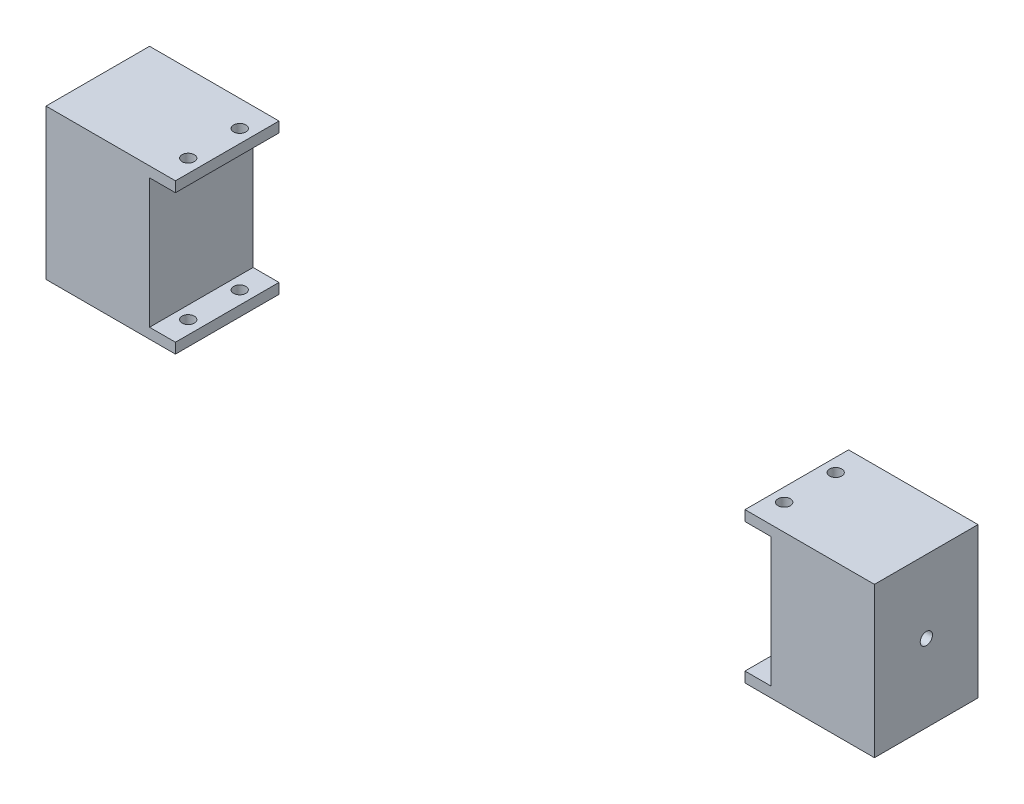
ISO-10303-21;
HEADER;
FILE_DESCRIPTION(('STEP AP214'),'2;1');
FILE_NAME('part.step','',(''),(''),'','','');
FILE_SCHEMA(('AUTOMOTIVE_DESIGN { 1 0 10303 214 1 1 1 1 }'));
ENDSEC;
DATA;
#1=APPLICATION_CONTEXT('core data for automotive mechanical design processes');
#2=APPLICATION_PROTOCOL_DEFINITION('international standard','automotive_design',2000,#1);
#3=PRODUCT_CONTEXT('',#1,'mechanical');
#4=PRODUCT('Part','Part','',(#3));
#5=PRODUCT_RELATED_PRODUCT_CATEGORY('part','',(#4));
#6=PRODUCT_DEFINITION_FORMATION('','',#4);
#7=PRODUCT_DEFINITION_CONTEXT('part definition',#1,'design');
#8=PRODUCT_DEFINITION('design','',#6,#7);
#9=PRODUCT_DEFINITION_SHAPE('','',#8);
#10=(LENGTH_UNIT() NAMED_UNIT(*) SI_UNIT(.MILLI.,.METRE.));
#11=(NAMED_UNIT(*) PLANE_ANGLE_UNIT() SI_UNIT($,.RADIAN.));
#12=(NAMED_UNIT(*) SI_UNIT($,.STERADIAN.) SOLID_ANGLE_UNIT());
#13=UNCERTAINTY_MEASURE_WITH_UNIT(LENGTH_MEASURE(1.E-05),#10,'distance_accuracy_value','');
#14=(GEOMETRIC_REPRESENTATION_CONTEXT(3) GLOBAL_UNCERTAINTY_ASSIGNED_CONTEXT((#13)) GLOBAL_UNIT_ASSIGNED_CONTEXT((#10,
#11,#12)) REPRESENTATION_CONTEXT('',''));
#15=CARTESIAN_POINT('',(0.,0.,0.));
#16=DIRECTION('',(0.,0.,1.));
#17=DIRECTION('',(1.,0.,0.));
#18=AXIS2_PLACEMENT_3D('',#15,#16,#17);
#19=CARTESIAN_POINT('',(0.,31.75,0.));
#20=DIRECTION('',(0.,0.,-1.));
#21=DIRECTION('',(1.,0.,0.));
#22=AXIS2_PLACEMENT_3D('',#19,#20,#21);
#23=PLANE('',#22);
#24=DIRECTION('',(0.,-1.,0.));
#25=VECTOR('',#24,1.);
#26=CARTESIAN_POINT('',(76.2,31.75,0.));
#27=LINE('',#26,#25);
#28=CARTESIAN_POINT('',(76.2,31.75,0.));
#29=VERTEX_POINT('',#28);
#30=CARTESIAN_POINT('',(76.2,0.,0.));
#31=VERTEX_POINT('',#30);
#32=EDGE_CURVE('E194',#29,#31,#27,.T.);
#33=ORIENTED_EDGE('',*,*,#32,.F.);
#34=DIRECTION('',(1.,0.,0.));
#35=VECTOR('',#34,1.);
#36=CARTESIAN_POINT('',(0.,31.75,0.));
#37=LINE('',#36,#35);
#38=CARTESIAN_POINT('',(69.85,31.75,0.));
#39=VERTEX_POINT('',#38);
#40=EDGE_CURVE('E148',#39,#29,#37,.T.);
#41=ORIENTED_EDGE('',*,*,#40,.F.);
#42=DIRECTION('',(0.,-1.,0.));
#43=VECTOR('',#42,1.);
#44=CARTESIAN_POINT('',(69.85,34.29,0.));
#45=LINE('',#44,#43);
#46=CARTESIAN_POINT('',(69.85,34.29,0.));
#47=VERTEX_POINT('',#46);
#48=EDGE_CURVE('E163',#47,#39,#45,.T.);
#49=ORIENTED_EDGE('',*,*,#48,.F.);
#50=DIRECTION('',(1.,0.,0.));
#51=VECTOR('',#50,1.);
#52=CARTESIAN_POINT('',(0.,34.29,0.));
#53=LINE('',#52,#51);
#54=CARTESIAN_POINT('',(101.6,34.29,0.));
#55=VERTEX_POINT('',#54);
#56=EDGE_CURVE('E154',#47,#55,#53,.T.);
#57=ORIENTED_EDGE('',*,*,#56,.T.);
#58=DIRECTION('',(0.,-1.,0.));
#59=VECTOR('',#58,1.);
#60=CARTESIAN_POINT('',(101.6,31.75,0.));
#61=LINE('',#60,#59);
#62=CARTESIAN_POINT('',(101.6,-2.54,0.));
#63=VERTEX_POINT('',#62);
#64=EDGE_CURVE('E12',#55,#63,#61,.T.);
#65=ORIENTED_EDGE('',*,*,#64,.T.);
#66=DIRECTION('',(1.,0.,0.));
#67=VECTOR('',#66,1.);
#68=CARTESIAN_POINT('',(0.,-2.54,0.));
#69=LINE('',#68,#67);
#70=CARTESIAN_POINT('',(69.85,-2.54,0.));
#71=VERTEX_POINT('',#70);
#72=EDGE_CURVE('E171',#71,#63,#69,.T.);
#73=ORIENTED_EDGE('',*,*,#72,.F.);
#74=DIRECTION('',(0.,1.,0.));
#75=VECTOR('',#74,1.);
#76=CARTESIAN_POINT('',(69.85,-2.54,0.));
#77=LINE('',#76,#75);
#78=CARTESIAN_POINT('',(69.85,0.,0.));
#79=VERTEX_POINT('',#78);
#80=EDGE_CURVE('E180',#71,#79,#77,.T.);
#81=ORIENTED_EDGE('',*,*,#80,.T.);
#82=DIRECTION('',(1.,0.,0.));
#83=VECTOR('',#82,1.);
#84=CARTESIAN_POINT('',(0.,0.,0.));
#85=LINE('',#84,#83);
#86=EDGE_CURVE('E182',#79,#31,#85,.T.);
#87=ORIENTED_EDGE('',*,*,#86,.T.);
#88=EDGE_LOOP('',(#33,#41,#49,#57,#65,#73,#81,#87));
#89=FACE_BOUND('',#88,.T.);
#90=ADVANCED_FACE('F50',(#89),#23,.T.);
#91=CARTESIAN_POINT('',(101.6,31.75,0.));
#92=DIRECTION('',(1.,0.,0.));
#93=DIRECTION('',(0.,0.,1.));
#94=AXIS2_PLACEMENT_3D('',#91,#92,#93);
#95=PLANE('',#94);
#96=CARTESIAN_POINT('',(101.6,16.4273165482752,12.6693549339168));
#97=DIRECTION('',(1.,0.,0.));
#98=DIRECTION('',(0.,0.,-1.));
#99=AXIS2_PLACEMENT_3D('',#96,#97,#98);
#100=CIRCLE('',#99,1.5);
#101=CARTESIAN_POINT('',(101.6,16.4273165482752,11.1693549339168));
#102=VERTEX_POINT('',#101);
#103=EDGE_CURVE('E53',#102,#102,#100,.T.);
#104=ORIENTED_EDGE('',*,*,#103,.F.);
#105=EDGE_LOOP('',(#104));
#106=FACE_BOUND('',#105,.T.);
#107=ORIENTED_EDGE('',*,*,#64,.F.);
#108=DIRECTION('',(0.,0.,1.));
#109=VECTOR('',#108,1.);
#110=CARTESIAN_POINT('',(101.6,34.29,0.));
#111=LINE('',#110,#109);
#112=CARTESIAN_POINT('',(101.6,34.29,25.4));
#113=VERTEX_POINT('',#112);
#114=EDGE_CURVE('E151',#55,#113,#111,.T.);
#115=ORIENTED_EDGE('',*,*,#114,.T.);
#116=DIRECTION('',(0.,-1.,0.));
#117=VECTOR('',#116,1.);
#118=CARTESIAN_POINT('',(101.6,31.75,25.4));
#119=LINE('',#118,#117);
#120=CARTESIAN_POINT('',(101.6,-2.54,25.4));
#121=VERTEX_POINT('',#120);
#122=EDGE_CURVE('E59',#113,#121,#119,.T.);
#123=ORIENTED_EDGE('',*,*,#122,.T.);
#124=DIRECTION('',(0.,0.,-1.));
#125=VECTOR('',#124,1.);
#126=CARTESIAN_POINT('',(101.6,-2.54,0.));
#127=LINE('',#126,#125);
#128=EDGE_CURVE('E175',#121,#63,#127,.T.);
#129=ORIENTED_EDGE('',*,*,#128,.T.);
#130=EDGE_LOOP('',(#107,#115,#123,#129));
#131=FACE_BOUND('',#130,.T.);
#132=ADVANCED_FACE('F233',(#106,#131),#95,.T.);
#133=CARTESIAN_POINT('',(0.,31.75,25.4));
#134=DIRECTION('',(0.,0.,1.));
#135=DIRECTION('',(-1.,0.,0.));
#136=AXIS2_PLACEMENT_3D('',#133,#134,#135);
#137=PLANE('',#136);
#138=ORIENTED_EDGE('',*,*,#122,.F.);
#139=DIRECTION('',(-1.,0.,0.));
#140=VECTOR('',#139,1.);
#141=CARTESIAN_POINT('',(0.,34.29,25.4));
#142=LINE('',#141,#140);
#143=CARTESIAN_POINT('',(69.85,34.29,25.4));
#144=VERTEX_POINT('',#143);
#145=EDGE_CURVE('E147',#113,#144,#142,.T.);
#146=ORIENTED_EDGE('',*,*,#145,.T.);
#147=DIRECTION('',(0.,-1.,0.));
#148=VECTOR('',#147,1.);
#149=CARTESIAN_POINT('',(69.85,34.29,25.4));
#150=LINE('',#149,#148);
#151=CARTESIAN_POINT('',(69.85,31.75,25.4));
#152=VERTEX_POINT('',#151);
#153=EDGE_CURVE('E157',#144,#152,#150,.T.);
#154=ORIENTED_EDGE('',*,*,#153,.T.);
#155=DIRECTION('',(-1.,0.,0.));
#156=VECTOR('',#155,1.);
#157=CARTESIAN_POINT('',(0.,31.75,25.4));
#158=LINE('',#157,#156);
#159=CARTESIAN_POINT('',(76.2,31.75,25.4));
#160=VERTEX_POINT('',#159);
#161=EDGE_CURVE('E160',#160,#152,#158,.T.);
#162=ORIENTED_EDGE('',*,*,#161,.F.);
#163=DIRECTION('',(0.,-1.,0.));
#164=VECTOR('',#163,1.);
#165=CARTESIAN_POINT('',(76.2,31.75,25.4));
#166=LINE('',#165,#164);
#167=CARTESIAN_POINT('',(76.2,0.,25.4));
#168=VERTEX_POINT('',#167);
#169=EDGE_CURVE('E198',#160,#168,#166,.T.);
#170=ORIENTED_EDGE('',*,*,#169,.T.);
#171=DIRECTION('',(-1.,0.,0.));
#172=VECTOR('',#171,1.);
#173=CARTESIAN_POINT('',(0.,0.,25.4));
#174=LINE('',#173,#172);
#175=CARTESIAN_POINT('',(69.85,0.,25.4));
#176=VERTEX_POINT('',#175);
#177=EDGE_CURVE('E172',#168,#176,#174,.T.);
#178=ORIENTED_EDGE('',*,*,#177,.T.);
#179=DIRECTION('',(0.,1.,0.));
#180=VECTOR('',#179,1.);
#181=CARTESIAN_POINT('',(69.85,-2.54,25.4));
#182=LINE('',#181,#180);
#183=CARTESIAN_POINT('',(69.85,-2.54,25.4));
#184=VERTEX_POINT('',#183);
#185=EDGE_CURVE('E187',#184,#176,#182,.T.);
#186=ORIENTED_EDGE('',*,*,#185,.F.);
#187=DIRECTION('',(-1.,0.,0.));
#188=VECTOR('',#187,1.);
#189=CARTESIAN_POINT('',(0.,-2.54,25.4));
#190=LINE('',#189,#188);
#191=EDGE_CURVE('E177',#121,#184,#190,.T.);
#192=ORIENTED_EDGE('',*,*,#191,.F.);
#193=EDGE_LOOP('',(#138,#146,#154,#162,#170,#178,#186,#192));
#194=FACE_BOUND('',#193,.T.);
#195=ADVANCED_FACE('F238',(#194),#137,.T.);
#196=CARTESIAN_POINT('',(76.2,31.75,0.));
#197=DIRECTION('',(-1.,0.,0.));
#198=DIRECTION('',(0.,0.,-1.));
#199=AXIS2_PLACEMENT_3D('',#196,#197,#198);
#200=PLANE('',#199);
#201=DIRECTION('',(0.,0.,1.));
#202=VECTOR('',#201,1.);
#203=CARTESIAN_POINT('',(76.2,0.,0.));
#204=LINE('',#203,#202);
#205=EDGE_CURVE('E190',#31,#168,#204,.T.);
#206=ORIENTED_EDGE('',*,*,#205,.T.);
#207=ORIENTED_EDGE('',*,*,#169,.F.);
#208=DIRECTION('',(0.,0.,1.));
#209=VECTOR('',#208,1.);
#210=CARTESIAN_POINT('',(76.2,31.75,0.));
#211=LINE('',#210,#209);
#212=EDGE_CURVE('E66',#29,#160,#211,.T.);
#213=ORIENTED_EDGE('',*,*,#212,.F.);
#214=ORIENTED_EDGE('',*,*,#32,.T.);
#215=EDGE_LOOP('',(#206,#207,#213,#214));
#216=FACE_BOUND('',#215,.T.);
#217=ADVANCED_FACE('F245',(#216),#200,.T.);
#218=CARTESIAN_POINT('',(69.85,-2.54,0.));
#219=DIRECTION('',(-1.,0.,0.));
#220=DIRECTION('',(0.,0.,-1.));
#221=AXIS2_PLACEMENT_3D('',#218,#219,#220);
#222=PLANE('',#221);
#223=DIRECTION('',(0.,0.,-1.));
#224=VECTOR('',#223,1.);
#225=CARTESIAN_POINT('',(69.85,0.,0.));
#226=LINE('',#225,#224);
#227=EDGE_CURVE('E166',#176,#79,#226,.T.);
#228=ORIENTED_EDGE('',*,*,#227,.T.);
#229=ORIENTED_EDGE('',*,*,#80,.F.);
#230=DIRECTION('',(0.,0.,-1.));
#231=VECTOR('',#230,1.);
#232=CARTESIAN_POINT('',(69.85,-2.54,0.));
#233=LINE('',#232,#231);
#234=EDGE_CURVE('E169',#184,#71,#233,.T.);
#235=ORIENTED_EDGE('',*,*,#234,.F.);
#236=ORIENTED_EDGE('',*,*,#185,.T.);
#237=EDGE_LOOP('',(#228,#229,#235,#236));
#238=FACE_BOUND('',#237,.T.);
#239=ADVANCED_FACE('F262',(#238),#222,.T.);
#240=CARTESIAN_POINT('',(0.,-2.54,0.));
#241=DIRECTION('',(0.,1.,0.));
#242=DIRECTION('',(0.,0.,1.));
#243=AXIS2_PLACEMENT_3D('',#240,#241,#242);
#244=PLANE('',#243);
#245=CARTESIAN_POINT('',(73.0866783409878,-2.54,6.39415450491426));
#246=DIRECTION('',(0.,1.,0.));
#247=DIRECTION('',(0.,0.,-1.));
#248=AXIS2_PLACEMENT_3D('',#245,#246,#247);
#249=CIRCLE('',#248,1.5);
#250=CARTESIAN_POINT('',(73.0866783409878,-2.54,4.89415450491426));
#251=VERTEX_POINT('',#250);
#252=EDGE_CURVE('E137',#251,#251,#249,.T.);
#253=ORIENTED_EDGE('',*,*,#252,.T.);
#254=EDGE_LOOP('',(#253));
#255=FACE_BOUND('',#254,.T.);
#256=CARTESIAN_POINT('',(73.0866783409878,-2.54,19.0308320788037));
#257=DIRECTION('',(0.,1.,0.));
#258=DIRECTION('',(0.,0.,-1.));
#259=AXIS2_PLACEMENT_3D('',#256,#257,#258);
#260=CIRCLE('',#259,1.5);
#261=CARTESIAN_POINT('',(73.0866783409878,-2.54,17.5308320788037));
#262=VERTEX_POINT('',#261);
#263=EDGE_CURVE('E141',#262,#262,#260,.T.);
#264=ORIENTED_EDGE('',*,*,#263,.T.);
#265=EDGE_LOOP('',(#264));
#266=FACE_BOUND('',#265,.T.);
#267=ORIENTED_EDGE('',*,*,#234,.T.);
#268=ORIENTED_EDGE('',*,*,#72,.T.);
#269=ORIENTED_EDGE('',*,*,#128,.F.);
#270=ORIENTED_EDGE('',*,*,#191,.T.);
#271=EDGE_LOOP('',(#267,#268,#269,#270));
#272=FACE_BOUND('',#271,.T.);
#273=ADVANCED_FACE('F259',(#255,#266,#272),#244,.F.);
#274=CARTESIAN_POINT('',(0.,0.,0.));
#275=DIRECTION('',(0.,1.,0.));
#276=DIRECTION('',(0.,0.,1.));
#277=AXIS2_PLACEMENT_3D('',#274,#275,#276);
#278=PLANE('',#277);
#279=CARTESIAN_POINT('',(73.0866783409878,0.,6.39415450491426));
#280=DIRECTION('',(0.,-1.,0.));
#281=DIRECTION('',(0.,0.,1.));
#282=AXIS2_PLACEMENT_3D('',#279,#280,#281);
#283=CIRCLE('',#282,1.5);
#284=CARTESIAN_POINT('',(73.0866783409878,0.,7.89415450491426));
#285=VERTEX_POINT('',#284);
#286=EDGE_CURVE('E140',#285,#285,#283,.T.);
#287=ORIENTED_EDGE('',*,*,#286,.T.);
#288=EDGE_LOOP('',(#287));
#289=FACE_BOUND('',#288,.T.);
#290=CARTESIAN_POINT('',(73.0866783409878,0.,19.0308320788037));
#291=DIRECTION('',(0.,-1.,0.));
#292=DIRECTION('',(0.,0.,1.));
#293=AXIS2_PLACEMENT_3D('',#290,#291,#292);
#294=CIRCLE('',#293,1.5);
#295=CARTESIAN_POINT('',(73.0866783409878,0.,20.5308320788037));
#296=VERTEX_POINT('',#295);
#297=EDGE_CURVE('E144',#296,#296,#294,.T.);
#298=ORIENTED_EDGE('',*,*,#297,.T.);
#299=EDGE_LOOP('',(#298));
#300=FACE_BOUND('',#299,.T.);
#301=ORIENTED_EDGE('',*,*,#86,.F.);
#302=ORIENTED_EDGE('',*,*,#227,.F.);
#303=ORIENTED_EDGE('',*,*,#177,.F.);
#304=ORIENTED_EDGE('',*,*,#205,.F.);
#305=EDGE_LOOP('',(#301,#302,#303,#304));
#306=FACE_BOUND('',#305,.T.);
#307=ADVANCED_FACE('F265',(#289,#300,#306),#278,.T.);
#308=CARTESIAN_POINT('',(69.85,34.29,0.));
#309=DIRECTION('',(-1.,0.,0.));
#310=DIRECTION('',(0.,0.,-1.));
#311=AXIS2_PLACEMENT_3D('',#308,#309,#310);
#312=PLANE('',#311);
#313=DIRECTION('',(0.,0.,1.));
#314=VECTOR('',#313,1.);
#315=CARTESIAN_POINT('',(69.85,31.75,0.));
#316=LINE('',#315,#314);
#317=EDGE_CURVE('E158',#39,#152,#316,.T.);
#318=ORIENTED_EDGE('',*,*,#317,.T.);
#319=ORIENTED_EDGE('',*,*,#153,.F.);
#320=DIRECTION('',(0.,0.,1.));
#321=VECTOR('',#320,1.);
#322=CARTESIAN_POINT('',(69.85,34.29,0.));
#323=LINE('',#322,#321);
#324=EDGE_CURVE('E145',#47,#144,#323,.T.);
#325=ORIENTED_EDGE('',*,*,#324,.F.);
#326=ORIENTED_EDGE('',*,*,#48,.T.);
#327=EDGE_LOOP('',(#318,#319,#325,#326));
#328=FACE_BOUND('',#327,.T.);
#329=ADVANCED_FACE('F250',(#328),#312,.T.);
#330=CARTESIAN_POINT('',(0.,34.29,0.));
#331=DIRECTION('',(0.,1.,0.));
#332=DIRECTION('',(0.,0.,1.));
#333=AXIS2_PLACEMENT_3D('',#330,#331,#332);
#334=PLANE('',#333);
#335=CARTESIAN_POINT('',(73.0866783409878,34.29,6.39415450491426));
#336=DIRECTION('',(0.,-1.,0.));
#337=DIRECTION('',(0.,0.,1.));
#338=AXIS2_PLACEMENT_3D('',#335,#336,#337);
#339=CIRCLE('',#338,1.5);
#340=CARTESIAN_POINT('',(73.0866783409878,34.29,7.89415450491426));
#341=VERTEX_POINT('',#340);
#342=EDGE_CURVE('E126',#341,#341,#339,.T.);
#343=ORIENTED_EDGE('',*,*,#342,.T.);
#344=EDGE_LOOP('',(#343));
#345=FACE_BOUND('',#344,.T.);
#346=CARTESIAN_POINT('',(73.0866783409878,34.29,19.0308320788037));
#347=DIRECTION('',(0.,-1.,0.));
#348=DIRECTION('',(0.,0.,1.));
#349=AXIS2_PLACEMENT_3D('',#346,#347,#348);
#350=CIRCLE('',#349,1.5);
#351=CARTESIAN_POINT('',(73.0866783409878,34.29,20.5308320788037));
#352=VERTEX_POINT('',#351);
#353=EDGE_CURVE('E131',#352,#352,#350,.T.);
#354=ORIENTED_EDGE('',*,*,#353,.T.);
#355=EDGE_LOOP('',(#354));
#356=FACE_BOUND('',#355,.T.);
#357=ORIENTED_EDGE('',*,*,#324,.T.);
#358=ORIENTED_EDGE('',*,*,#145,.F.);
#359=ORIENTED_EDGE('',*,*,#114,.F.);
#360=ORIENTED_EDGE('',*,*,#56,.F.);
#361=EDGE_LOOP('',(#357,#358,#359,#360));
#362=FACE_BOUND('',#361,.T.);
#363=ADVANCED_FACE('F214',(#345,#356,#362),#334,.T.);
#364=CARTESIAN_POINT('',(0.,31.75,0.));
#365=DIRECTION('',(0.,1.,0.));
#366=DIRECTION('',(0.,0.,1.));
#367=AXIS2_PLACEMENT_3D('',#364,#365,#366);
#368=PLANE('',#367);
#369=CARTESIAN_POINT('',(73.0866783409878,31.75,6.39415450491426));
#370=DIRECTION('',(0.,-1.,0.));
#371=DIRECTION('',(0.,0.,1.));
#372=AXIS2_PLACEMENT_3D('',#369,#370,#371);
#373=CIRCLE('',#372,1.5);
#374=CARTESIAN_POINT('',(73.0866783409878,31.75,7.89415450491426));
#375=VERTEX_POINT('',#374);
#376=EDGE_CURVE('E130',#375,#375,#373,.T.);
#377=ORIENTED_EDGE('',*,*,#376,.F.);
#378=EDGE_LOOP('',(#377));
#379=FACE_BOUND('',#378,.T.);
#380=CARTESIAN_POINT('',(73.0866783409878,31.75,19.0308320788037));
#381=DIRECTION('',(0.,-1.,0.));
#382=DIRECTION('',(0.,0.,1.));
#383=AXIS2_PLACEMENT_3D('',#380,#381,#382);
#384=CIRCLE('',#383,1.5);
#385=CARTESIAN_POINT('',(73.0866783409878,31.75,20.5308320788037));
#386=VERTEX_POINT('',#385);
#387=EDGE_CURVE('E134',#386,#386,#384,.T.);
#388=ORIENTED_EDGE('',*,*,#387,.F.);
#389=EDGE_LOOP('',(#388));
#390=FACE_BOUND('',#389,.T.);
#391=ORIENTED_EDGE('',*,*,#212,.T.);
#392=ORIENTED_EDGE('',*,*,#161,.T.);
#393=ORIENTED_EDGE('',*,*,#317,.F.);
#394=ORIENTED_EDGE('',*,*,#40,.T.);
#395=EDGE_LOOP('',(#391,#392,#393,#394));
#396=FACE_BOUND('',#395,.T.);
#397=ADVANCED_FACE('F210',(#379,#390,#396),#368,.F.);
#398=CARTESIAN_POINT('',(73.0866783409878,-2.54,19.0308320788037));
#399=DIRECTION('',(0.,-1.,0.));
#400=DIRECTION('',(0.,0.,-1.));
#401=AXIS2_PLACEMENT_3D('',#398,#399,#400);
#402=CYLINDRICAL_SURFACE('',#401,1.5);
#403=ORIENTED_EDGE('',*,*,#297,.F.);
#404=EDGE_LOOP('',(#403));
#405=FACE_BOUND('',#404,.T.);
#406=ORIENTED_EDGE('',*,*,#263,.F.);
#407=EDGE_LOOP('',(#406));
#408=FACE_BOUND('',#407,.T.);
#409=ADVANCED_FACE('F213',(#405,#408),#402,.F.);
#410=CARTESIAN_POINT('',(73.0866783409878,-2.54,6.39415450491426));
#411=DIRECTION('',(0.,-1.,0.));
#412=DIRECTION('',(0.,0.,-1.));
#413=AXIS2_PLACEMENT_3D('',#410,#411,#412);
#414=CYLINDRICAL_SURFACE('',#413,1.5);
#415=ORIENTED_EDGE('',*,*,#286,.F.);
#416=EDGE_LOOP('',(#415));
#417=FACE_BOUND('',#416,.T.);
#418=ORIENTED_EDGE('',*,*,#252,.F.);
#419=EDGE_LOOP('',(#418));
#420=FACE_BOUND('',#419,.T.);
#421=ADVANCED_FACE('F220',(#417,#420),#414,.F.);
#422=CARTESIAN_POINT('',(73.0866783409878,34.29,19.0308320788037));
#423=DIRECTION('',(0.,1.,0.));
#424=DIRECTION('',(0.,0.,1.));
#425=AXIS2_PLACEMENT_3D('',#422,#423,#424);
#426=CYLINDRICAL_SURFACE('',#425,1.5);
#427=ORIENTED_EDGE('',*,*,#353,.F.);
#428=EDGE_LOOP('',(#427));
#429=FACE_BOUND('',#428,.T.);
#430=ORIENTED_EDGE('',*,*,#387,.T.);
#431=EDGE_LOOP('',(#430));
#432=FACE_BOUND('',#431,.T.);
#433=ADVANCED_FACE('F218',(#429,#432),#426,.F.);
#434=CARTESIAN_POINT('',(73.0866783409878,34.29,6.39415450491426));
#435=DIRECTION('',(0.,1.,0.));
#436=DIRECTION('',(0.,0.,1.));
#437=AXIS2_PLACEMENT_3D('',#434,#435,#436);
#438=CYLINDRICAL_SURFACE('',#437,1.5);
#439=ORIENTED_EDGE('',*,*,#342,.F.);
#440=EDGE_LOOP('',(#439));
#441=FACE_BOUND('',#440,.T.);
#442=ORIENTED_EDGE('',*,*,#376,.T.);
#443=EDGE_LOOP('',(#442));
#444=FACE_BOUND('',#443,.T.);
#445=ADVANCED_FACE('F118',(#441,#444),#438,.F.);
#446=CARTESIAN_POINT('',(96.5199999999999,16.4273165482752,12.6693549339168));
#447=DIRECTION('',(1.,0.,0.));
#448=DIRECTION('',(0.,0.,-1.));
#449=AXIS2_PLACEMENT_3D('',#446,#447,#448);
#450=CONICAL_SURFACE('',#449,1.5,1.02974425867665);
#451=CARTESIAN_POINT('',(95.6187090714586,16.4273165482752,12.6693549339168));
#452=VERTEX_POINT('',#451);
#453=VERTEX_LOOP('',#452);
#454=FACE_BOUND('',#453,.T.);
#455=CARTESIAN_POINT('',(96.5199999999999,16.4273165482752,12.6693549339168));
#456=DIRECTION('',(1.,0.,0.));
#457=DIRECTION('',(0.,0.,-1.));
#458=AXIS2_PLACEMENT_3D('',#455,#456,#457);
#459=CIRCLE('',#458,1.5);
#460=CARTESIAN_POINT('',(96.5199999999999,16.4273165482752,11.1693549339168));
#461=VERTEX_POINT('',#460);
#462=EDGE_CURVE('E122',#461,#461,#459,.T.);
#463=ORIENTED_EDGE('',*,*,#462,.T.);
#464=EDGE_LOOP('',(#463));
#465=FACE_BOUND('',#464,.T.);
#466=ADVANCED_FACE('F114',(#454,#465),#450,.F.);
#467=CARTESIAN_POINT('',(104.14,16.4273165482752,12.6693549339168));
#468=DIRECTION('',(1.,0.,0.));
#469=DIRECTION('',(0.,0.,-1.));
#470=AXIS2_PLACEMENT_3D('',#467,#468,#469);
#471=CYLINDRICAL_SURFACE('',#470,1.5);
#472=ORIENTED_EDGE('',*,*,#103,.T.);
#473=EDGE_LOOP('',(#472));
#474=FACE_BOUND('',#473,.T.);
#475=ORIENTED_EDGE('',*,*,#462,.F.);
#476=EDGE_LOOP('',(#475));
#477=FACE_BOUND('',#476,.T.);
#478=ADVANCED_FACE('F117',(#474,#477),#471,.F.);
#479=CLOSED_SHELL('',(#90,#132,#195,#217,#239,#273,#307,#329,#363,#397,#409,#421,#433,#445,#466,#478));
#480=MANIFOLD_SOLID_BREP('B2',#479);
#481=CARTESIAN_POINT('',(0.,31.75,0.));
#482=DIRECTION('',(0.,0.,-1.));
#483=DIRECTION('',(-1.,0.,0.));
#484=AXIS2_PLACEMENT_3D('',#481,#482,#483);
#485=PLANE('',#484);
#486=DIRECTION('',(0.,-1.,0.));
#487=VECTOR('',#486,1.);
#488=CARTESIAN_POINT('',(-76.2,31.75,0.));
#489=LINE('',#488,#487);
#490=CARTESIAN_POINT('',(-76.2,31.75,0.));
#491=VERTEX_POINT('',#490);
#492=CARTESIAN_POINT('',(-76.2,0.,0.));
#493=VERTEX_POINT('',#492);
#494=EDGE_CURVE('E607',#491,#493,#489,.T.);
#495=ORIENTED_EDGE('',*,*,#494,.T.);
#496=DIRECTION('',(-1.,0.,0.));
#497=VECTOR('',#496,1.);
#498=CARTESIAN_POINT('',(0.,0.,0.));
#499=LINE('',#498,#497);
#500=CARTESIAN_POINT('',(-69.85,0.,0.));
#501=VERTEX_POINT('',#500);
#502=EDGE_CURVE('E595',#501,#493,#499,.T.);
#503=ORIENTED_EDGE('',*,*,#502,.F.);
#504=DIRECTION('',(0.,1.,0.));
#505=VECTOR('',#504,1.);
#506=CARTESIAN_POINT('',(-69.85,-2.54,0.));
#507=LINE('',#506,#505);
#508=CARTESIAN_POINT('',(-69.85,-2.54,0.));
#509=VERTEX_POINT('',#508);
#510=EDGE_CURVE('E592',#509,#501,#507,.T.);
#511=ORIENTED_EDGE('',*,*,#510,.F.);
#512=DIRECTION('',(-1.,0.,0.));
#513=VECTOR('',#512,1.);
#514=CARTESIAN_POINT('',(0.,-2.54,0.));
#515=LINE('',#514,#513);
#516=CARTESIAN_POINT('',(-101.6,-2.54,0.));
#517=VERTEX_POINT('',#516);
#518=EDGE_CURVE('E582',#509,#517,#515,.T.);
#519=ORIENTED_EDGE('',*,*,#518,.T.);
#520=DIRECTION('',(0.,-1.,0.));
#521=VECTOR('',#520,1.);
#522=CARTESIAN_POINT('',(-101.6,31.75,0.));
#523=LINE('',#522,#521);
#524=CARTESIAN_POINT('',(-101.6,34.29,0.));
#525=VERTEX_POINT('',#524);
#526=EDGE_CURVE('E48',#525,#517,#523,.T.);
#527=ORIENTED_EDGE('',*,*,#526,.F.);
#528=DIRECTION('',(-1.,0.,0.));
#529=VECTOR('',#528,1.);
#530=CARTESIAN_POINT('',(0.,34.29,0.));
#531=LINE('',#530,#529);
#532=CARTESIAN_POINT('',(-69.85,34.29,0.));
#533=VERTEX_POINT('',#532);
#534=EDGE_CURVE('E565',#533,#525,#531,.T.);
#535=ORIENTED_EDGE('',*,*,#534,.F.);
#536=DIRECTION('',(0.,-1.,0.));
#537=VECTOR('',#536,1.);
#538=CARTESIAN_POINT('',(-69.85,34.29,0.));
#539=LINE('',#538,#537);
#540=CARTESIAN_POINT('',(-69.85,31.75,0.));
#541=VERTEX_POINT('',#540);
#542=EDGE_CURVE('E574',#533,#541,#539,.T.);
#543=ORIENTED_EDGE('',*,*,#542,.T.);
#544=DIRECTION('',(-1.,0.,0.));
#545=VECTOR('',#544,1.);
#546=CARTESIAN_POINT('',(0.,31.75,0.));
#547=LINE('',#546,#545);
#548=EDGE_CURVE('E560',#541,#491,#547,.T.);
#549=ORIENTED_EDGE('',*,*,#548,.T.);
#550=EDGE_LOOP('',(#495,#503,#511,#519,#527,#535,#543,#549));
#551=FACE_BOUND('',#550,.T.);
#552=ADVANCED_FACE('F463',(#551),#485,.T.);
#553=CARTESIAN_POINT('',(-101.6,31.75,0.));
#554=DIRECTION('',(-1.,0.,0.));
#555=DIRECTION('',(0.,0.,1.));
#556=AXIS2_PLACEMENT_3D('',#553,#554,#555);
#557=PLANE('',#556);
#558=CARTESIAN_POINT('',(-101.6,16.4273165482751,12.6693549339169));
#559=DIRECTION('',(-1.,0.,0.));
#560=DIRECTION('',(0.,0.,1.));
#561=AXIS2_PLACEMENT_3D('',#558,#559,#560);
#562=CIRCLE('',#561,1.5);
#563=CARTESIAN_POINT('',(-101.6,16.4273165482751,14.1693549339169));
#564=VERTEX_POINT('',#563);
#565=EDGE_CURVE('E466',#564,#564,#562,.T.);
#566=ORIENTED_EDGE('',*,*,#565,.F.);
#567=EDGE_LOOP('',(#566));
#568=FACE_BOUND('',#567,.T.);
#569=ORIENTED_EDGE('',*,*,#526,.T.);
#570=DIRECTION('',(0.,0.,-1.));
#571=VECTOR('',#570,1.);
#572=CARTESIAN_POINT('',(-101.6,-2.54,0.));
#573=LINE('',#572,#571);
#574=CARTESIAN_POINT('',(-101.6,-2.54,25.4));
#575=VERTEX_POINT('',#574);
#576=EDGE_CURVE('E586',#575,#517,#573,.T.);
#577=ORIENTED_EDGE('',*,*,#576,.F.);
#578=DIRECTION('',(0.,-1.,0.));
#579=VECTOR('',#578,1.);
#580=CARTESIAN_POINT('',(-101.6,31.75,25.4));
#581=LINE('',#580,#579);
#582=CARTESIAN_POINT('',(-101.6,34.29,25.4));
#583=VERTEX_POINT('',#582);
#584=EDGE_CURVE('E472',#583,#575,#581,.T.);
#585=ORIENTED_EDGE('',*,*,#584,.F.);
#586=DIRECTION('',(0.,0.,1.));
#587=VECTOR('',#586,1.);
#588=CARTESIAN_POINT('',(-101.6,34.29,0.));
#589=LINE('',#588,#587);
#590=EDGE_CURVE('E562',#525,#583,#589,.T.);
#591=ORIENTED_EDGE('',*,*,#590,.F.);
#592=EDGE_LOOP('',(#569,#577,#585,#591));
#593=FACE_BOUND('',#592,.T.);
#594=ADVANCED_FACE('F634',(#568,#593),#557,.T.);
#595=CARTESIAN_POINT('',(0.,31.75,25.4));
#596=DIRECTION('',(0.,0.,1.));
#597=DIRECTION('',(1.,0.,0.));
#598=AXIS2_PLACEMENT_3D('',#595,#596,#597);
#599=PLANE('',#598);
#600=ORIENTED_EDGE('',*,*,#584,.T.);
#601=DIRECTION('',(1.,0.,0.));
#602=VECTOR('',#601,1.);
#603=CARTESIAN_POINT('',(0.,-2.54,25.4));
#604=LINE('',#603,#602);
#605=CARTESIAN_POINT('',(-69.85,-2.54,25.4));
#606=VERTEX_POINT('',#605);
#607=EDGE_CURVE('E589',#575,#606,#604,.T.);
#608=ORIENTED_EDGE('',*,*,#607,.T.);
#609=DIRECTION('',(0.,1.,0.));
#610=VECTOR('',#609,1.);
#611=CARTESIAN_POINT('',(-69.85,-2.54,25.4));
#612=LINE('',#611,#610);
#613=CARTESIAN_POINT('',(-69.85,0.,25.4));
#614=VERTEX_POINT('',#613);
#615=EDGE_CURVE('E599',#606,#614,#612,.T.);
#616=ORIENTED_EDGE('',*,*,#615,.T.);
#617=DIRECTION('',(1.,0.,0.));
#618=VECTOR('',#617,1.);
#619=CARTESIAN_POINT('',(0.,0.,25.4));
#620=LINE('',#619,#618);
#621=CARTESIAN_POINT('',(-76.2,0.,25.4));
#622=VERTEX_POINT('',#621);
#623=EDGE_CURVE('E583',#622,#614,#620,.T.);
#624=ORIENTED_EDGE('',*,*,#623,.F.);
#625=DIRECTION('',(0.,-1.,0.));
#626=VECTOR('',#625,1.);
#627=CARTESIAN_POINT('',(-76.2,31.75,25.4));
#628=LINE('',#627,#626);
#629=CARTESIAN_POINT('',(-76.2,31.75,25.4));
#630=VERTEX_POINT('',#629);
#631=EDGE_CURVE('E611',#630,#622,#628,.T.);
#632=ORIENTED_EDGE('',*,*,#631,.F.);
#633=DIRECTION('',(1.,0.,0.));
#634=VECTOR('',#633,1.);
#635=CARTESIAN_POINT('',(0.,31.75,25.4));
#636=LINE('',#635,#634);
#637=CARTESIAN_POINT('',(-69.85,31.75,25.4));
#638=VERTEX_POINT('',#637);
#639=EDGE_CURVE('E479',#630,#638,#636,.T.);
#640=ORIENTED_EDGE('',*,*,#639,.T.);
#641=DIRECTION('',(0.,-1.,0.));
#642=VECTOR('',#641,1.);
#643=CARTESIAN_POINT('',(-69.85,34.29,25.4));
#644=LINE('',#643,#642);
#645=CARTESIAN_POINT('',(-69.85,34.29,25.4));
#646=VERTEX_POINT('',#645);
#647=EDGE_CURVE('E568',#646,#638,#644,.T.);
#648=ORIENTED_EDGE('',*,*,#647,.F.);
#649=DIRECTION('',(1.,0.,0.));
#650=VECTOR('',#649,1.);
#651=CARTESIAN_POINT('',(0.,34.29,25.4));
#652=LINE('',#651,#650);
#653=EDGE_CURVE('E559',#583,#646,#652,.T.);
#654=ORIENTED_EDGE('',*,*,#653,.F.);
#655=EDGE_LOOP('',(#600,#608,#616,#624,#632,#640,#648,#654));
#656=FACE_BOUND('',#655,.T.);
#657=ADVANCED_FACE('F639',(#656),#599,.T.);
#658=CARTESIAN_POINT('',(-76.2,31.75,0.));
#659=DIRECTION('',(1.,0.,0.));
#660=DIRECTION('',(0.,0.,-1.));
#661=AXIS2_PLACEMENT_3D('',#658,#659,#660);
#662=PLANE('',#661);
#663=DIRECTION('',(0.,0.,1.));
#664=VECTOR('',#663,1.);
#665=CARTESIAN_POINT('',(-76.2,0.,0.));
#666=LINE('',#665,#664);
#667=EDGE_CURVE('E602',#493,#622,#666,.T.);
#668=ORIENTED_EDGE('',*,*,#667,.F.);
#669=ORIENTED_EDGE('',*,*,#494,.F.);
#670=DIRECTION('',(0.,0.,1.));
#671=VECTOR('',#670,1.);
#672=CARTESIAN_POINT('',(-76.2,31.75,0.));
#673=LINE('',#672,#671);
#674=EDGE_CURVE('E604',#491,#630,#673,.T.);
#675=ORIENTED_EDGE('',*,*,#674,.T.);
#676=ORIENTED_EDGE('',*,*,#631,.T.);
#677=EDGE_LOOP('',(#668,#669,#675,#676));
#678=FACE_BOUND('',#677,.T.);
#679=ADVANCED_FACE('F646',(#678),#662,.T.);
#680=CARTESIAN_POINT('',(-69.85,-2.54,0.));
#681=DIRECTION('',(1.,0.,0.));
#682=DIRECTION('',(0.,0.,-1.));
#683=AXIS2_PLACEMENT_3D('',#680,#681,#682);
#684=PLANE('',#683);
#685=DIRECTION('',(0.,0.,-1.));
#686=VECTOR('',#685,1.);
#687=CARTESIAN_POINT('',(-69.85,0.,0.));
#688=LINE('',#687,#686);
#689=EDGE_CURVE('E576',#614,#501,#688,.T.);
#690=ORIENTED_EDGE('',*,*,#689,.F.);
#691=ORIENTED_EDGE('',*,*,#615,.F.);
#692=DIRECTION('',(0.,0.,-1.));
#693=VECTOR('',#692,1.);
#694=CARTESIAN_POINT('',(-69.85,-2.54,0.));
#695=LINE('',#694,#693);
#696=EDGE_CURVE('E579',#606,#509,#695,.T.);
#697=ORIENTED_EDGE('',*,*,#696,.T.);
#698=ORIENTED_EDGE('',*,*,#510,.T.);
#699=EDGE_LOOP('',(#690,#691,#697,#698));
#700=FACE_BOUND('',#699,.T.);
#701=ADVANCED_FACE('F652',(#700),#684,.T.);
#702=CARTESIAN_POINT('',(0.,-2.54,0.));
#703=DIRECTION('',(0.,1.,0.));
#704=DIRECTION('',(0.,0.,1.));
#705=AXIS2_PLACEMENT_3D('',#702,#703,#704);
#706=PLANE('',#705);
#707=CARTESIAN_POINT('',(-73.0866783409878,-2.54,6.39415450491426));
#708=DIRECTION('',(0.,-1.,0.));
#709=DIRECTION('',(0.,0.,-1.));
#710=AXIS2_PLACEMENT_3D('',#707,#708,#709);
#711=CIRCLE('',#710,1.5);
#712=CARTESIAN_POINT('',(-73.0866783409878,-2.54,4.89415450491426));
#713=VERTEX_POINT('',#712);
#714=EDGE_CURVE('E548',#713,#713,#711,.T.);
#715=ORIENTED_EDGE('',*,*,#714,.F.);
#716=EDGE_LOOP('',(#715));
#717=FACE_BOUND('',#716,.T.);
#718=CARTESIAN_POINT('',(-73.0866783409878,-2.54,19.0308320788037));
#719=DIRECTION('',(0.,-1.,0.));
#720=DIRECTION('',(0.,0.,-1.));
#721=AXIS2_PLACEMENT_3D('',#718,#719,#720);
#722=CIRCLE('',#721,1.5);
#723=CARTESIAN_POINT('',(-73.0866783409878,-2.54,17.5308320788037));
#724=VERTEX_POINT('',#723);
#725=EDGE_CURVE('E552',#724,#724,#722,.T.);
#726=ORIENTED_EDGE('',*,*,#725,.F.);
#727=EDGE_LOOP('',(#726));
#728=FACE_BOUND('',#727,.T.);
#729=ORIENTED_EDGE('',*,*,#696,.F.);
#730=ORIENTED_EDGE('',*,*,#607,.F.);
#731=ORIENTED_EDGE('',*,*,#576,.T.);
#732=ORIENTED_EDGE('',*,*,#518,.F.);
#733=EDGE_LOOP('',(#729,#730,#731,#732));
#734=FACE_BOUND('',#733,.T.);
#735=ADVANCED_FACE('F656',(#717,#728,#734),#706,.F.);
#736=CARTESIAN_POINT('',(0.,0.,0.));
#737=DIRECTION('',(0.,1.,0.));
#738=DIRECTION('',(0.,0.,1.));
#739=AXIS2_PLACEMENT_3D('',#736,#737,#738);
#740=PLANE('',#739);
#741=CARTESIAN_POINT('',(-73.0866783409878,0.,6.39415450491426));
#742=DIRECTION('',(0.,1.,0.));
#743=DIRECTION('',(0.,0.,1.));
#744=AXIS2_PLACEMENT_3D('',#741,#742,#743);
#745=CIRCLE('',#744,1.5);
#746=CARTESIAN_POINT('',(-73.0866783409878,0.,7.89415450491426));
#747=VERTEX_POINT('',#746);
#748=EDGE_CURVE('E551',#747,#747,#745,.T.);
#749=ORIENTED_EDGE('',*,*,#748,.F.);
#750=EDGE_LOOP('',(#749));
#751=FACE_BOUND('',#750,.T.);
#752=CARTESIAN_POINT('',(-73.0866783409878,0.,19.0308320788037));
#753=DIRECTION('',(0.,1.,0.));
#754=DIRECTION('',(0.,0.,1.));
#755=AXIS2_PLACEMENT_3D('',#752,#753,#754);
#756=CIRCLE('',#755,1.5);
#757=CARTESIAN_POINT('',(-73.0866783409878,0.,20.5308320788037));
#758=VERTEX_POINT('',#757);
#759=EDGE_CURVE('E555',#758,#758,#756,.T.);
#760=ORIENTED_EDGE('',*,*,#759,.F.);
#761=EDGE_LOOP('',(#760));
#762=FACE_BOUND('',#761,.T.);
#763=ORIENTED_EDGE('',*,*,#502,.T.);
#764=ORIENTED_EDGE('',*,*,#667,.T.);
#765=ORIENTED_EDGE('',*,*,#623,.T.);
#766=ORIENTED_EDGE('',*,*,#689,.T.);
#767=EDGE_LOOP('',(#763,#764,#765,#766));
#768=FACE_BOUND('',#767,.T.);
#769=ADVANCED_FACE('F649',(#751,#762,#768),#740,.T.);
#770=CARTESIAN_POINT('',(-69.85,34.29,0.));
#771=DIRECTION('',(1.,0.,0.));
#772=DIRECTION('',(0.,0.,-1.));
#773=AXIS2_PLACEMENT_3D('',#770,#771,#772);
#774=PLANE('',#773);
#775=DIRECTION('',(0.,0.,1.));
#776=VECTOR('',#775,1.);
#777=CARTESIAN_POINT('',(-69.85,31.75,0.));
#778=LINE('',#777,#776);
#779=EDGE_CURVE('E569',#541,#638,#778,.T.);
#780=ORIENTED_EDGE('',*,*,#779,.F.);
#781=ORIENTED_EDGE('',*,*,#542,.F.);
#782=DIRECTION('',(0.,0.,1.));
#783=VECTOR('',#782,1.);
#784=CARTESIAN_POINT('',(-69.85,34.29,0.));
#785=LINE('',#784,#783);
#786=EDGE_CURVE('E556',#533,#646,#785,.T.);
#787=ORIENTED_EDGE('',*,*,#786,.T.);
#788=ORIENTED_EDGE('',*,*,#647,.T.);
#789=EDGE_LOOP('',(#780,#781,#787,#788));
#790=FACE_BOUND('',#789,.T.);
#791=ADVANCED_FACE('F669',(#790),#774,.T.);
#792=CARTESIAN_POINT('',(0.,34.29,0.));
#793=DIRECTION('',(0.,1.,0.));
#794=DIRECTION('',(0.,0.,1.));
#795=AXIS2_PLACEMENT_3D('',#792,#793,#794);
#796=PLANE('',#795);
#797=CARTESIAN_POINT('',(-73.0866783409878,34.29,6.39415450491426));
#798=DIRECTION('',(0.,1.,0.));
#799=DIRECTION('',(0.,0.,1.));
#800=AXIS2_PLACEMENT_3D('',#797,#798,#799);
#801=CIRCLE('',#800,1.5);
#802=CARTESIAN_POINT('',(-73.0866783409878,34.29,7.89415450491426));
#803=VERTEX_POINT('',#802);
#804=EDGE_CURVE('E537',#803,#803,#801,.T.);
#805=ORIENTED_EDGE('',*,*,#804,.F.);
#806=EDGE_LOOP('',(#805));
#807=FACE_BOUND('',#806,.T.);
#808=CARTESIAN_POINT('',(-73.0866783409878,34.29,19.0308320788037));
#809=DIRECTION('',(0.,1.,0.));
#810=DIRECTION('',(0.,0.,1.));
#811=AXIS2_PLACEMENT_3D('',#808,#809,#810);
#812=CIRCLE('',#811,1.5);
#813=CARTESIAN_POINT('',(-73.0866783409878,34.29,20.5308320788037));
#814=VERTEX_POINT('',#813);
#815=EDGE_CURVE('E542',#814,#814,#812,.T.);
#816=ORIENTED_EDGE('',*,*,#815,.F.);
#817=EDGE_LOOP('',(#816));
#818=FACE_BOUND('',#817,.T.);
#819=ORIENTED_EDGE('',*,*,#786,.F.);
#820=ORIENTED_EDGE('',*,*,#534,.T.);
#821=ORIENTED_EDGE('',*,*,#590,.T.);
#822=ORIENTED_EDGE('',*,*,#653,.T.);
#823=EDGE_LOOP('',(#819,#820,#821,#822));
#824=FACE_BOUND('',#823,.T.);
#825=ADVANCED_FACE('F664',(#807,#818,#824),#796,.T.);
#826=CARTESIAN_POINT('',(0.,31.75,0.));
#827=DIRECTION('',(0.,1.,0.));
#828=DIRECTION('',(0.,0.,1.));
#829=AXIS2_PLACEMENT_3D('',#826,#827,#828);
#830=PLANE('',#829);
#831=CARTESIAN_POINT('',(-73.0866783409878,31.75,6.39415450491426));
#832=DIRECTION('',(0.,1.,0.));
#833=DIRECTION('',(0.,0.,1.));
#834=AXIS2_PLACEMENT_3D('',#831,#832,#833);
#835=CIRCLE('',#834,1.5);
#836=CARTESIAN_POINT('',(-73.0866783409878,31.75,7.89415450491426));
#837=VERTEX_POINT('',#836);
#838=EDGE_CURVE('E541',#837,#837,#835,.T.);
#839=ORIENTED_EDGE('',*,*,#838,.T.);
#840=EDGE_LOOP('',(#839));
#841=FACE_BOUND('',#840,.T.);
#842=CARTESIAN_POINT('',(-73.0866783409878,31.75,19.0308320788037));
#843=DIRECTION('',(0.,1.,0.));
#844=DIRECTION('',(0.,0.,1.));
#845=AXIS2_PLACEMENT_3D('',#842,#843,#844);
#846=CIRCLE('',#845,1.5);
#847=CARTESIAN_POINT('',(-73.0866783409878,31.75,20.5308320788037));
#848=VERTEX_POINT('',#847);
#849=EDGE_CURVE('E545',#848,#848,#846,.T.);
#850=ORIENTED_EDGE('',*,*,#849,.T.);
#851=EDGE_LOOP('',(#850));
#852=FACE_BOUND('',#851,.T.);
#853=ORIENTED_EDGE('',*,*,#674,.F.);
#854=ORIENTED_EDGE('',*,*,#548,.F.);
#855=ORIENTED_EDGE('',*,*,#779,.T.);
#856=ORIENTED_EDGE('',*,*,#639,.F.);
#857=EDGE_LOOP('',(#853,#854,#855,#856));
#858=FACE_BOUND('',#857,.T.);
#859=ADVANCED_FACE('F620',(#841,#852,#858),#830,.F.);
#860=CARTESIAN_POINT('',(-73.0866783409878,-2.54,19.0308320788037));
#861=DIRECTION('',(0.,-1.,0.));
#862=DIRECTION('',(0.,0.,-1.));
#863=AXIS2_PLACEMENT_3D('',#860,#861,#862);
#864=CYLINDRICAL_SURFACE('',#863,1.5);
#865=ORIENTED_EDGE('',*,*,#759,.T.);
#866=EDGE_LOOP('',(#865));
#867=FACE_BOUND('',#866,.T.);
#868=ORIENTED_EDGE('',*,*,#725,.T.);
#869=EDGE_LOOP('',(#868));
#870=FACE_BOUND('',#869,.T.);
#871=ADVANCED_FACE('F671',(#867,#870),#864,.F.);
#872=CARTESIAN_POINT('',(-73.0866783409878,-2.54,6.39415450491426));
#873=DIRECTION('',(0.,-1.,0.));
#874=DIRECTION('',(0.,0.,-1.));
#875=AXIS2_PLACEMENT_3D('',#872,#873,#874);
#876=CYLINDRICAL_SURFACE('',#875,1.5);
#877=ORIENTED_EDGE('',*,*,#748,.T.);
#878=EDGE_LOOP('',(#877));
#879=FACE_BOUND('',#878,.T.);
#880=ORIENTED_EDGE('',*,*,#714,.T.);
#881=EDGE_LOOP('',(#880));
#882=FACE_BOUND('',#881,.T.);
#883=ADVANCED_FACE('F630',(#879,#882),#876,.F.);
#884=CARTESIAN_POINT('',(-73.0866783409878,34.29,19.0308320788037));
#885=DIRECTION('',(0.,1.,0.));
#886=DIRECTION('',(0.,0.,1.));
#887=AXIS2_PLACEMENT_3D('',#884,#885,#886);
#888=CYLINDRICAL_SURFACE('',#887,1.5);
#889=ORIENTED_EDGE('',*,*,#815,.T.);
#890=EDGE_LOOP('',(#889));
#891=FACE_BOUND('',#890,.T.);
#892=ORIENTED_EDGE('',*,*,#849,.F.);
#893=EDGE_LOOP('',(#892));
#894=FACE_BOUND('',#893,.T.);
#895=ADVANCED_FACE('F624',(#891,#894),#888,.F.);
#896=CARTESIAN_POINT('',(-73.0866783409878,34.29,6.39415450491426));
#897=DIRECTION('',(0.,1.,0.));
#898=DIRECTION('',(0.,0.,1.));
#899=AXIS2_PLACEMENT_3D('',#896,#897,#898);
#900=CYLINDRICAL_SURFACE('',#899,1.5);
#901=ORIENTED_EDGE('',*,*,#804,.T.);
#902=EDGE_LOOP('',(#901));
#903=FACE_BOUND('',#902,.T.);
#904=ORIENTED_EDGE('',*,*,#838,.F.);
#905=EDGE_LOOP('',(#904));
#906=FACE_BOUND('',#905,.T.);
#907=ADVANCED_FACE('F529',(#903,#906),#900,.F.);
#908=CARTESIAN_POINT('',(-96.52,16.4273165482751,12.6693549339169));
#909=DIRECTION('',(-1.,0.,0.));
#910=DIRECTION('',(0.,0.,1.));
#911=AXIS2_PLACEMENT_3D('',#908,#909,#910);
#912=CONICAL_SURFACE('',#911,1.5,1.02974425867665);
#913=CARTESIAN_POINT('',(-95.6187090714587,16.4273165482751,12.6693549339169));
#914=VERTEX_POINT('',#913);
#915=VERTEX_LOOP('',#914);
#916=FACE_BOUND('',#915,.T.);
#917=CARTESIAN_POINT('',(-96.52,16.4273165482751,12.6693549339169));
#918=DIRECTION('',(-1.,0.,0.));
#919=DIRECTION('',(0.,0.,1.));
#920=AXIS2_PLACEMENT_3D('',#917,#918,#919);
#921=CIRCLE('',#920,1.5);
#922=CARTESIAN_POINT('',(-96.52,16.4273165482751,14.1693549339169));
#923=VERTEX_POINT('',#922);
#924=EDGE_CURVE('E533',#923,#923,#921,.T.);
#925=ORIENTED_EDGE('',*,*,#924,.T.);
#926=EDGE_LOOP('',(#925));
#927=FACE_BOUND('',#926,.T.);
#928=ADVANCED_FACE('F525',(#916,#927),#912,.F.);
#929=CARTESIAN_POINT('',(-104.14,16.4273165482751,12.6693549339169));
#930=DIRECTION('',(-1.,0.,0.));
#931=DIRECTION('',(0.,0.,1.));
#932=AXIS2_PLACEMENT_3D('',#929,#930,#931);
#933=CYLINDRICAL_SURFACE('',#932,1.5);
#934=ORIENTED_EDGE('',*,*,#565,.T.);
#935=EDGE_LOOP('',(#934));
#936=FACE_BOUND('',#935,.T.);
#937=ORIENTED_EDGE('',*,*,#924,.F.);
#938=EDGE_LOOP('',(#937));
#939=FACE_BOUND('',#938,.T.);
#940=ADVANCED_FACE('F528',(#936,#939),#933,.F.);
#941=CLOSED_SHELL('',(#552,#594,#657,#679,#701,#735,#769,#791,#825,#859,#871,#883,#895,#907,
#928,#940));
#942=MANIFOLD_SOLID_BREP('B6',#941);
#943=ADVANCED_BREP_SHAPE_REPRESENTATION('',(#18,#480,#942),#14);
#944=SHAPE_DEFINITION_REPRESENTATION(#9,#943);
ENDSEC;
END-ISO-10303-21;
